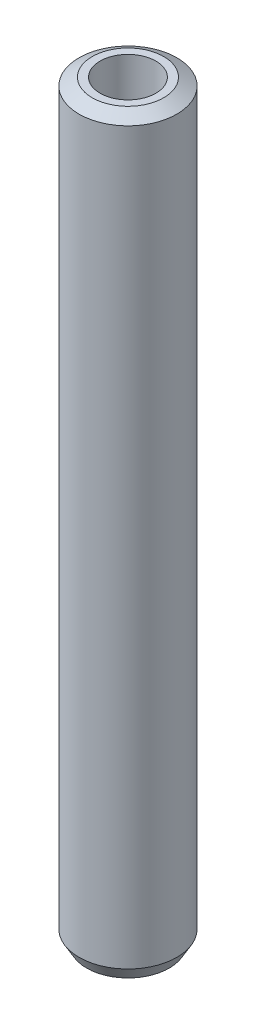
ISO-10303-21;
HEADER;
FILE_DESCRIPTION(('STEP AP214'),'2;1');
FILE_NAME('part.step','',(''),(''),'','','');
FILE_SCHEMA(('AUTOMOTIVE_DESIGN { 1 0 10303 214 1 1 1 1 }'));
ENDSEC;
DATA;
#1=APPLICATION_CONTEXT('core data for automotive mechanical design processes');
#2=APPLICATION_PROTOCOL_DEFINITION('international standard','automotive_design',2000,#1);
#3=PRODUCT_CONTEXT('',#1,'mechanical');
#4=PRODUCT('Part','Part','',(#3));
#5=PRODUCT_RELATED_PRODUCT_CATEGORY('part','',(#4));
#6=PRODUCT_DEFINITION_FORMATION('','',#4);
#7=PRODUCT_DEFINITION_CONTEXT('part definition',#1,'design');
#8=PRODUCT_DEFINITION('design','',#6,#7);
#9=PRODUCT_DEFINITION_SHAPE('','',#8);
#10=(LENGTH_UNIT() NAMED_UNIT(*) SI_UNIT(.MILLI.,.METRE.));
#11=(NAMED_UNIT(*) PLANE_ANGLE_UNIT() SI_UNIT($,.RADIAN.));
#12=(NAMED_UNIT(*) SI_UNIT($,.STERADIAN.) SOLID_ANGLE_UNIT());
#13=UNCERTAINTY_MEASURE_WITH_UNIT(LENGTH_MEASURE(1.E-05),#10,'distance_accuracy_value','');
#14=(GEOMETRIC_REPRESENTATION_CONTEXT(3) GLOBAL_UNCERTAINTY_ASSIGNED_CONTEXT((#13)) GLOBAL_UNIT_ASSIGNED_CONTEXT((#10,
#11,#12)) REPRESENTATION_CONTEXT('',''));
#15=CARTESIAN_POINT('',(0.,0.,0.));
#16=DIRECTION('',(0.,0.,1.));
#17=DIRECTION('',(1.,0.,0.));
#18=AXIS2_PLACEMENT_3D('',#15,#16,#17);
#19=CARTESIAN_POINT('',(0.,537.425727067724,0.));
#20=DIRECTION('',(0.,-1.,0.));
#21=DIRECTION('',(0.,0.,-1.));
#22=AXIS2_PLACEMENT_3D('',#19,#20,#21);
#23=CYLINDRICAL_SURFACE('',#22,35.);
#24=CARTESIAN_POINT('',(0.,531.983269118878,0.));
#25=DIRECTION('',(0.,1.,0.));
#26=DIRECTION('',(0.,0.,1.));
#27=AXIS2_PLACEMENT_3D('',#24,#25,#26);
#28=CIRCLE('',#27,35.);
#29=CARTESIAN_POINT('',(0.,531.983269118878,35.));
#30=VERTEX_POINT('',#29);
#31=EDGE_CURVE('E50',#30,#30,#28,.F.);
#32=ORIENTED_EDGE('',*,*,#31,.T.);
#33=EDGE_LOOP('',(#32));
#34=FACE_BOUND('',#33,.T.);
#35=CARTESIAN_POINT('',(0.,9.42661368545805,0.));
#36=DIRECTION('',(0.,1.,0.));
#37=DIRECTION('',(0.,0.,1.));
#38=AXIS2_PLACEMENT_3D('',#35,#36,#37);
#39=CIRCLE('',#38,35.);
#40=CARTESIAN_POINT('',(0.,9.42661368545805,35.));
#41=VERTEX_POINT('',#40);
#42=EDGE_CURVE('E51',#41,#41,#39,.T.);
#43=ORIENTED_EDGE('',*,*,#42,.T.);
#44=EDGE_LOOP('',(#43));
#45=FACE_BOUND('',#44,.T.);
#46=ADVANCED_FACE('F39',(#34,#45),#23,.T.);
#47=CARTESIAN_POINT('',(0.,537.425727067724,0.));
#48=DIRECTION('',(0.,1.,0.));
#49=DIRECTION('',(0.,0.,1.));
#50=AXIS2_PLACEMENT_3D('',#47,#48,#49);
#51=PLANE('',#50);
#52=CARTESIAN_POINT('',(0.,537.425727067724,0.));
#53=DIRECTION('',(0.,1.,0.));
#54=DIRECTION('',(0.,0.,1.));
#55=AXIS2_PLACEMENT_3D('',#52,#53,#54);
#56=CIRCLE('',#55,25.573386314542);
#57=CARTESIAN_POINT('',(0.,537.425727067724,25.573386314542));
#58=VERTEX_POINT('',#57);
#59=EDGE_CURVE('E54',#58,#58,#56,.T.);
#60=ORIENTED_EDGE('',*,*,#59,.T.);
#61=EDGE_LOOP('',(#60));
#62=FACE_BOUND('',#61,.T.);
#63=CARTESIAN_POINT('',(0.,537.425727067724,0.));
#64=DIRECTION('',(0.,1.,0.));
#65=DIRECTION('',(0.,0.,1.));
#66=AXIS2_PLACEMENT_3D('',#63,#64,#65);
#67=CIRCLE('',#66,19.9690985764333);
#68=CARTESIAN_POINT('',(0.,537.425727067724,19.9690985764333));
#69=VERTEX_POINT('',#68);
#70=EDGE_CURVE('E58',#69,#69,#67,.T.);
#71=ORIENTED_EDGE('',*,*,#70,.F.);
#72=EDGE_LOOP('',(#71));
#73=FACE_BOUND('',#72,.T.);
#74=ADVANCED_FACE('F69',(#62,#73),#51,.T.);
#75=CARTESIAN_POINT('',(0.,0.,0.));
#76=DIRECTION('',(0.,1.,0.));
#77=DIRECTION('',(0.,0.,1.));
#78=AXIS2_PLACEMENT_3D('',#75,#76,#77);
#79=PLANE('',#78);
#80=CARTESIAN_POINT('',(0.,0.,0.));
#81=DIRECTION('',(0.,1.,0.));
#82=DIRECTION('',(0.,0.,1.));
#83=AXIS2_PLACEMENT_3D('',#80,#81,#82);
#84=CIRCLE('',#83,29.5575420511541);
#85=CARTESIAN_POINT('',(0.,0.,29.5575420511541));
#86=VERTEX_POINT('',#85);
#87=EDGE_CURVE('E10',#86,#86,#84,.F.);
#88=ORIENTED_EDGE('',*,*,#87,.T.);
#89=EDGE_LOOP('',(#88));
#90=FACE_BOUND('',#89,.T.);
#91=CARTESIAN_POINT('',(0.,0.,0.));
#92=DIRECTION('',(0.,1.,0.));
#93=DIRECTION('',(0.,0.,1.));
#94=AXIS2_PLACEMENT_3D('',#91,#92,#93);
#95=CIRCLE('',#94,19.9690985764333);
#96=CARTESIAN_POINT('',(0.,0.,19.9690985764333));
#97=VERTEX_POINT('',#96);
#98=EDGE_CURVE('E63',#97,#97,#95,.T.);
#99=ORIENTED_EDGE('',*,*,#98,.T.);
#100=EDGE_LOOP('',(#99));
#101=FACE_BOUND('',#100,.T.);
#102=ADVANCED_FACE('F75',(#90,#101),#79,.F.);
#103=CARTESIAN_POINT('',(0.,537.425727067724,0.));
#104=DIRECTION('',(0.,-1.,0.));
#105=DIRECTION('',(0.,0.,-1.));
#106=AXIS2_PLACEMENT_3D('',#103,#104,#105);
#107=CYLINDRICAL_SURFACE('',#106,19.9690985764333);
#108=ORIENTED_EDGE('',*,*,#70,.T.);
#109=EDGE_LOOP('',(#108));
#110=FACE_BOUND('',#109,.T.);
#111=ORIENTED_EDGE('',*,*,#98,.F.);
#112=EDGE_LOOP('',(#111));
#113=FACE_BOUND('',#112,.T.);
#114=ADVANCED_FACE('F70',(#110,#113),#107,.F.);
#115=CARTESIAN_POINT('',(0.,537.425727067724,0.));
#116=DIRECTION('',(0.,-1.,0.));
#117=DIRECTION('',(0.,0.,-1.));
#118=AXIS2_PLACEMENT_3D('',#115,#116,#117);
#119=CONICAL_SURFACE('',#118,25.573386314542,1.04719755119658);
#120=ORIENTED_EDGE('',*,*,#31,.F.);
#121=EDGE_LOOP('',(#120));
#122=FACE_BOUND('',#121,.T.);
#123=ORIENTED_EDGE('',*,*,#59,.F.);
#124=EDGE_LOOP('',(#123));
#125=FACE_BOUND('',#124,.T.);
#126=ADVANCED_FACE('F81',(#122,#125),#119,.T.);
#127=CARTESIAN_POINT('',(0.,9.42661368545805,0.));
#128=DIRECTION('',(0.,1.,0.));
#129=DIRECTION('',(0.,0.,1.));
#130=AXIS2_PLACEMENT_3D('',#127,#128,#129);
#131=CONICAL_SURFACE('',#130,35.,0.523598775598304);
#132=ORIENTED_EDGE('',*,*,#87,.F.);
#133=EDGE_LOOP('',(#132));
#134=FACE_BOUND('',#133,.T.);
#135=ORIENTED_EDGE('',*,*,#42,.F.);
#136=EDGE_LOOP('',(#135));
#137=FACE_BOUND('',#136,.T.);
#138=ADVANCED_FACE('F45',(#134,#137),#131,.T.);
#139=CLOSED_SHELL('',(#46,#74,#102,#114,#126,#138));
#140=MANIFOLD_SOLID_BREP('B2',#139);
#141=ADVANCED_BREP_SHAPE_REPRESENTATION('',(#18,#140),#14);
#142=SHAPE_DEFINITION_REPRESENTATION(#9,#141);
ENDSEC;
END-ISO-10303-21;
